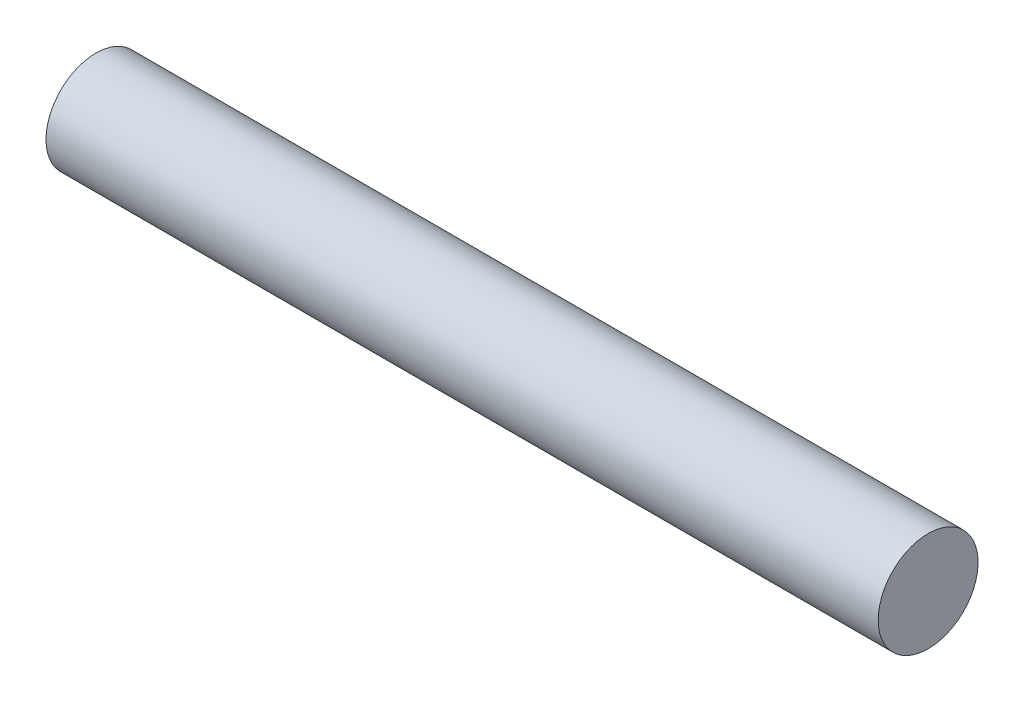
ISO-10303-21;
HEADER;
FILE_DESCRIPTION(('STEP AP214'),'2;1');
FILE_NAME('part.step','',(''),(''),'','','');
FILE_SCHEMA(('AUTOMOTIVE_DESIGN { 1 0 10303 214 1 1 1 1 }'));
ENDSEC;
DATA;
#1=APPLICATION_CONTEXT('core data for automotive mechanical design processes');
#2=APPLICATION_PROTOCOL_DEFINITION('international standard','automotive_design',2000,#1);
#3=PRODUCT_CONTEXT('',#1,'mechanical');
#4=PRODUCT('Part','Part','',(#3));
#5=PRODUCT_RELATED_PRODUCT_CATEGORY('part','',(#4));
#6=PRODUCT_DEFINITION_FORMATION('','',#4);
#7=PRODUCT_DEFINITION_CONTEXT('part definition',#1,'design');
#8=PRODUCT_DEFINITION('design','',#6,#7);
#9=PRODUCT_DEFINITION_SHAPE('','',#8);
#10=(LENGTH_UNIT() NAMED_UNIT(*) SI_UNIT(.MILLI.,.METRE.));
#11=(NAMED_UNIT(*) PLANE_ANGLE_UNIT() SI_UNIT($,.RADIAN.));
#12=(NAMED_UNIT(*) SI_UNIT($,.STERADIAN.) SOLID_ANGLE_UNIT());
#13=UNCERTAINTY_MEASURE_WITH_UNIT(LENGTH_MEASURE(1.E-05),#10,'distance_accuracy_value','');
#14=(GEOMETRIC_REPRESENTATION_CONTEXT(3) GLOBAL_UNCERTAINTY_ASSIGNED_CONTEXT((#13)) GLOBAL_UNIT_ASSIGNED_CONTEXT((#10,
#11,#12)) REPRESENTATION_CONTEXT('',''));
#15=CARTESIAN_POINT('',(0.,0.,0.));
#16=DIRECTION('',(0.,0.,1.));
#17=DIRECTION('',(1.,0.,0.));
#18=AXIS2_PLACEMENT_3D('',#15,#16,#17);
#19=CARTESIAN_POINT('',(0.,0.,0.));
#20=DIRECTION('',(1.,0.,0.));
#21=DIRECTION('',(0.,0.,-1.));
#22=AXIS2_PLACEMENT_3D('',#19,#20,#21);
#23=PLANE('',#22);
#24=CARTESIAN_POINT('',(0.,0.,0.));
#25=DIRECTION('',(-1.,0.,0.));
#26=DIRECTION('',(0.,0.,1.));
#27=AXIS2_PLACEMENT_3D('',#24,#25,#26);
#28=CIRCLE('',#27,12.);
#29=CARTESIAN_POINT('',(0.,0.,12.));
#30=VERTEX_POINT('',#29);
#31=EDGE_CURVE('E10',#30,#30,#28,.T.);
#32=ORIENTED_EDGE('',*,*,#31,.T.);
#33=EDGE_LOOP('',(#32));
#34=FACE_BOUND('',#33,.T.);
#35=ADVANCED_FACE('F30',(#34),#23,.F.);
#36=CARTESIAN_POINT('',(0.,0.,0.));
#37=DIRECTION('',(-1.,0.,0.));
#38=DIRECTION('',(0.,0.,1.));
#39=AXIS2_PLACEMENT_3D('',#36,#37,#38);
#40=CYLINDRICAL_SURFACE('',#39,11.9999999999993);
#41=ORIENTED_EDGE('',*,*,#31,.F.);
#42=EDGE_LOOP('',(#41));
#43=FACE_BOUND('',#42,.T.);
#44=CARTESIAN_POINT('',(200.,0.,0.));
#45=DIRECTION('',(-1.,0.,0.));
#46=DIRECTION('',(0.,0.,1.));
#47=AXIS2_PLACEMENT_3D('',#44,#45,#46);
#48=CIRCLE('',#47,11.9999999999986);
#49=CARTESIAN_POINT('',(200.,0.,11.9999999999986));
#50=VERTEX_POINT('',#49);
#51=EDGE_CURVE('E36',#50,#50,#48,.T.);
#52=ORIENTED_EDGE('',*,*,#51,.T.);
#53=EDGE_LOOP('',(#52));
#54=FACE_BOUND('',#53,.T.);
#55=ADVANCED_FACE('F42',(#43,#54),#40,.T.);
#56=CARTESIAN_POINT('',(200.,0.,-11.9999999999986));
#57=DIRECTION('',(-1.,0.,0.));
#58=DIRECTION('',(0.,0.,1.));
#59=AXIS2_PLACEMENT_3D('',#56,#57,#58);
#60=PLANE('',#59);
#61=ORIENTED_EDGE('',*,*,#51,.F.);
#62=EDGE_LOOP('',(#61));
#63=FACE_BOUND('',#62,.T.);
#64=ADVANCED_FACE('F44',(#63),#60,.F.);
#65=CLOSED_SHELL('',(#35,#55,#64));
#66=MANIFOLD_SOLID_BREP('B2',#65);
#67=ADVANCED_BREP_SHAPE_REPRESENTATION('',(#18,#66),#14);
#68=SHAPE_DEFINITION_REPRESENTATION(#9,#67);
ENDSEC;
END-ISO-10303-21;
